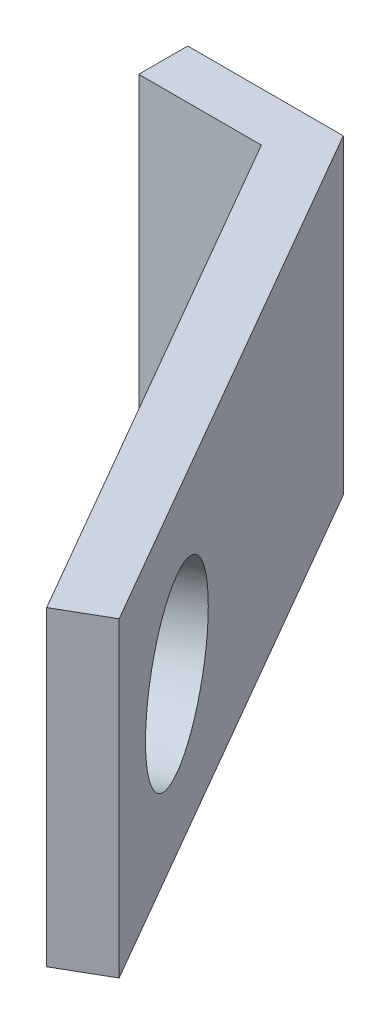
ISO-10303-21;
HEADER;
FILE_DESCRIPTION(('STEP AP214'),'2;1');
FILE_NAME('part.step','',(''),(''),'','','');
FILE_SCHEMA(('AUTOMOTIVE_DESIGN { 1 0 10303 214 1 1 1 1 }'));
ENDSEC;
DATA;
#1=APPLICATION_CONTEXT('core data for automotive mechanical design processes');
#2=APPLICATION_PROTOCOL_DEFINITION('international standard','automotive_design',2000,#1);
#3=PRODUCT_CONTEXT('',#1,'mechanical');
#4=PRODUCT('Part','Part','',(#3));
#5=PRODUCT_RELATED_PRODUCT_CATEGORY('part','',(#4));
#6=PRODUCT_DEFINITION_FORMATION('','',#4);
#7=PRODUCT_DEFINITION_CONTEXT('part definition',#1,'design');
#8=PRODUCT_DEFINITION('design','',#6,#7);
#9=PRODUCT_DEFINITION_SHAPE('','',#8);
#10=(LENGTH_UNIT() NAMED_UNIT(*) SI_UNIT(.MILLI.,.METRE.));
#11=(NAMED_UNIT(*) PLANE_ANGLE_UNIT() SI_UNIT($,.RADIAN.));
#12=(NAMED_UNIT(*) SI_UNIT($,.STERADIAN.) SOLID_ANGLE_UNIT());
#13=UNCERTAINTY_MEASURE_WITH_UNIT(LENGTH_MEASURE(1.E-05),#10,'distance_accuracy_value','');
#14=(GEOMETRIC_REPRESENTATION_CONTEXT(3) GLOBAL_UNCERTAINTY_ASSIGNED_CONTEXT((#13)) GLOBAL_UNIT_ASSIGNED_CONTEXT((#10,
#11,#12)) REPRESENTATION_CONTEXT('',''));
#15=CARTESIAN_POINT('',(0.,0.,0.));
#16=DIRECTION('',(0.,0.,1.));
#17=DIRECTION('',(1.,0.,0.));
#18=AXIS2_PLACEMENT_3D('',#15,#16,#17);
#19=CARTESIAN_POINT('',(0.,0.,2.));
#20=DIRECTION('',(1.,0.,0.));
#21=DIRECTION('',(0.,0.,-1.));
#22=AXIS2_PLACEMENT_3D('',#19,#20,#21);
#23=PLANE('',#22);
#24=DIRECTION('',(0.,-1.,0.));
#25=VECTOR('',#24,1.);
#26=CARTESIAN_POINT('',(0.,0.,0.));
#27=LINE('',#26,#25);
#28=CARTESIAN_POINT('',(0.,12.7,0.));
#29=VERTEX_POINT('',#28);
#30=CARTESIAN_POINT('',(0.,0.,0.));
#31=VERTEX_POINT('',#30);
#32=EDGE_CURVE('E136',#29,#31,#27,.T.);
#33=ORIENTED_EDGE('',*,*,#32,.T.);
#34=DIRECTION('',(0.,0.,-1.));
#35=VECTOR('',#34,1.);
#36=CARTESIAN_POINT('',(0.,0.,2.));
#37=LINE('',#36,#35);
#38=CARTESIAN_POINT('',(0.,0.,2.));
#39=VERTEX_POINT('',#38);
#40=EDGE_CURVE('E11',#39,#31,#37,.T.);
#41=ORIENTED_EDGE('',*,*,#40,.F.);
#42=DIRECTION('',(0.,-1.,0.));
#43=VECTOR('',#42,1.);
#44=CARTESIAN_POINT('',(0.,0.,2.));
#45=LINE('',#44,#43);
#46=CARTESIAN_POINT('',(0.,12.7,2.));
#47=VERTEX_POINT('',#46);
#48=EDGE_CURVE('E137',#47,#39,#45,.T.);
#49=ORIENTED_EDGE('',*,*,#48,.F.);
#50=DIRECTION('',(0.,0.,-1.));
#51=VECTOR('',#50,1.);
#52=CARTESIAN_POINT('',(0.,12.7,2.));
#53=LINE('',#52,#51);
#54=EDGE_CURVE('E48',#47,#29,#53,.T.);
#55=ORIENTED_EDGE('',*,*,#54,.T.);
#56=EDGE_LOOP('',(#33,#41,#49,#55));
#57=FACE_BOUND('',#56,.T.);
#58=ADVANCED_FACE('F39',(#57),#23,.F.);
#59=CARTESIAN_POINT('',(0.,0.,2.));
#60=DIRECTION('',(0.,1.,0.));
#61=DIRECTION('',(0.,0.,1.));
#62=AXIS2_PLACEMENT_3D('',#59,#60,#61);
#63=PLANE('',#62);
#64=DIRECTION('',(1.,0.,0.));
#65=VECTOR('',#64,1.);
#66=CARTESIAN_POINT('',(0.,0.,0.));
#67=LINE('',#66,#65);
#68=CARTESIAN_POINT('',(6.35,0.,0.));
#69=VERTEX_POINT('',#68);
#70=EDGE_CURVE('E116',#31,#69,#67,.T.);
#71=ORIENTED_EDGE('',*,*,#70,.T.);
#72=DIRECTION('',(0.500000000000004,0.,0.866025403784436));
#73=VECTOR('',#72,1.);
#74=CARTESIAN_POINT('',(6.35,0.,0.));
#75=LINE('',#74,#73);
#76=CARTESIAN_POINT('',(18.8500000000001,0.,21.6506350946109));
#77=VERTEX_POINT('',#76);
#78=EDGE_CURVE('E97',#69,#77,#75,.T.);
#79=ORIENTED_EDGE('',*,*,#78,.T.);
#80=DIRECTION('',(-0.866025403784435,0.,0.500000000000006));
#81=VECTOR('',#80,1.);
#82=CARTESIAN_POINT('',(18.8500000000001,0.,21.6506350946109));
#83=LINE('',#82,#81);
#84=CARTESIAN_POINT('',(16.9750000000001,0.,22.7331668493415));
#85=VERTEX_POINT('',#84);
#86=EDGE_CURVE('E107',#77,#85,#83,.T.);
#87=ORIENTED_EDGE('',*,*,#86,.T.);
#88=DIRECTION('',(-0.500000000000004,0.,-0.866025403784436));
#89=VECTOR('',#88,1.);
#90=CARTESIAN_POINT('',(16.9750000000001,0.,22.7331668493415));
#91=LINE('',#90,#89);
#92=CARTESIAN_POINT('',(5.00470053837927,0.,2.));
#93=VERTEX_POINT('',#92);
#94=EDGE_CURVE('E104',#85,#93,#91,.T.);
#95=ORIENTED_EDGE('',*,*,#94,.T.);
#96=DIRECTION('',(1.,0.,0.));
#97=VECTOR('',#96,1.);
#98=CARTESIAN_POINT('',(0.,0.,2.));
#99=LINE('',#98,#97);
#100=EDGE_CURVE('E60',#39,#93,#99,.T.);
#101=ORIENTED_EDGE('',*,*,#100,.F.);
#102=ORIENTED_EDGE('',*,*,#40,.T.);
#103=EDGE_LOOP('',(#71,#79,#87,#95,#101,#102));
#104=FACE_BOUND('',#103,.T.);
#105=ADVANCED_FACE('F115',(#104),#63,.F.);
#106=CARTESIAN_POINT('',(0.,12.7,2.));
#107=DIRECTION('',(0.,-1.,0.));
#108=DIRECTION('',(0.,0.,-1.));
#109=AXIS2_PLACEMENT_3D('',#106,#107,#108);
#110=PLANE('',#109);
#111=DIRECTION('',(-0.500000000000004,0.,-0.866025403784436));
#112=VECTOR('',#111,1.);
#113=CARTESIAN_POINT('',(6.35,12.7,0.));
#114=LINE('',#113,#112);
#115=CARTESIAN_POINT('',(18.8500000000001,12.7,21.6506350946109));
#116=VERTEX_POINT('',#115);
#117=CARTESIAN_POINT('',(6.35,12.7,0.));
#118=VERTEX_POINT('',#117);
#119=EDGE_CURVE('E99',#116,#118,#114,.T.);
#120=ORIENTED_EDGE('',*,*,#119,.T.);
#121=DIRECTION('',(-1.,0.,0.));
#122=VECTOR('',#121,1.);
#123=CARTESIAN_POINT('',(0.,12.7,0.));
#124=LINE('',#123,#122);
#125=EDGE_CURVE('E140',#118,#29,#124,.T.);
#126=ORIENTED_EDGE('',*,*,#125,.T.);
#127=ORIENTED_EDGE('',*,*,#54,.F.);
#128=DIRECTION('',(-1.,0.,0.));
#129=VECTOR('',#128,1.);
#130=CARTESIAN_POINT('',(0.,12.7,2.));
#131=LINE('',#130,#129);
#132=CARTESIAN_POINT('',(5.00470053837927,12.7,2.));
#133=VERTEX_POINT('',#132);
#134=EDGE_CURVE('E143',#133,#47,#131,.T.);
#135=ORIENTED_EDGE('',*,*,#134,.F.);
#136=DIRECTION('',(0.500000000000004,0.,0.866025403784436));
#137=VECTOR('',#136,1.);
#138=CARTESIAN_POINT('',(16.9750000000001,12.7,22.7331668493415));
#139=LINE('',#138,#137);
#140=CARTESIAN_POINT('',(16.9750000000001,12.7,22.7331668493415));
#141=VERTEX_POINT('',#140);
#142=EDGE_CURVE('E124',#133,#141,#139,.T.);
#143=ORIENTED_EDGE('',*,*,#142,.T.);
#144=DIRECTION('',(0.866025403784435,0.,-0.500000000000006));
#145=VECTOR('',#144,1.);
#146=CARTESIAN_POINT('',(18.8500000000001,12.7,21.6506350946109));
#147=LINE('',#146,#145);
#148=EDGE_CURVE('E130',#141,#116,#147,.T.);
#149=ORIENTED_EDGE('',*,*,#148,.T.);
#150=EDGE_LOOP('',(#120,#126,#127,#135,#143,#149));
#151=FACE_BOUND('',#150,.T.);
#152=ADVANCED_FACE('F168',(#151),#110,.F.);
#153=CARTESIAN_POINT('',(0.,0.,2.));
#154=DIRECTION('',(0.,0.,-1.));
#155=DIRECTION('',(-1.,0.,0.));
#156=AXIS2_PLACEMENT_3D('',#153,#154,#155);
#157=PLANE('',#156);
#158=ORIENTED_EDGE('',*,*,#100,.T.);
#159=DIRECTION('',(0.,1.,0.));
#160=VECTOR('',#159,1.);
#161=CARTESIAN_POINT('',(5.00470053837927,0.,2.));
#162=LINE('',#161,#160);
#163=EDGE_CURVE('E55',#93,#133,#162,.T.);
#164=ORIENTED_EDGE('',*,*,#163,.T.);
#165=ORIENTED_EDGE('',*,*,#134,.T.);
#166=ORIENTED_EDGE('',*,*,#48,.T.);
#167=EDGE_LOOP('',(#158,#164,#165,#166));
#168=FACE_BOUND('',#167,.T.);
#169=ADVANCED_FACE('F166',(#168),#157,.F.);
#170=CARTESIAN_POINT('',(0.,0.,0.));
#171=DIRECTION('',(0.,0.,-1.));
#172=DIRECTION('',(-1.,0.,0.));
#173=AXIS2_PLACEMENT_3D('',#170,#171,#172);
#174=PLANE('',#173);
#175=ORIENTED_EDGE('',*,*,#32,.F.);
#176=ORIENTED_EDGE('',*,*,#125,.F.);
#177=DIRECTION('',(0.,1.,0.));
#178=VECTOR('',#177,1.);
#179=CARTESIAN_POINT('',(6.35,0.,0.));
#180=LINE('',#179,#178);
#181=EDGE_CURVE('E151',#69,#118,#180,.T.);
#182=ORIENTED_EDGE('',*,*,#181,.F.);
#183=ORIENTED_EDGE('',*,*,#70,.F.);
#184=EDGE_LOOP('',(#175,#176,#182,#183));
#185=FACE_BOUND('',#184,.T.);
#186=ADVANCED_FACE('F165',(#185),#174,.T.);
#187=CARTESIAN_POINT('',(16.9750000000001,39.9359482118762,22.7331668493415));
#188=DIRECTION('',(-0.866025403784436,0.,0.500000000000004));
#189=DIRECTION('',(0.500000000000004,0.,0.866025403784436));
#190=AXIS2_PLACEMENT_3D('',#187,#188,#189);
#191=PLANE('',#190);
#192=CARTESIAN_POINT('',(13.7547005383793,6.35,17.1554445662276));
#193=DIRECTION('',(-0.866025403784436,0.,0.500000000000004));
#194=DIRECTION('',(0.500000000000004,0.,0.866025403784436));
#195=AXIS2_PLACEMENT_3D('',#192,#193,#194);
#196=CIRCLE('',#195,3.5);
#197=CARTESIAN_POINT('',(15.5047005383793,6.35,20.1865334794732));
#198=VERTEX_POINT('',#197);
#199=EDGE_CURVE('E122',#198,#198,#196,.T.);
#200=ORIENTED_EDGE('',*,*,#199,.F.);
#201=EDGE_LOOP('',(#200));
#202=FACE_BOUND('',#201,.T.);
#203=ORIENTED_EDGE('',*,*,#163,.F.);
#204=ORIENTED_EDGE('',*,*,#94,.F.);
#205=DIRECTION('',(0.,-1.,0.));
#206=VECTOR('',#205,1.);
#207=CARTESIAN_POINT('',(16.9750000000001,39.9359482118762,22.7331668493415));
#208=LINE('',#207,#206);
#209=EDGE_CURVE('E103',#141,#85,#208,.T.);
#210=ORIENTED_EDGE('',*,*,#209,.F.);
#211=ORIENTED_EDGE('',*,*,#142,.F.);
#212=EDGE_LOOP('',(#203,#204,#210,#211));
#213=FACE_BOUND('',#212,.T.);
#214=ADVANCED_FACE('F170',(#202,#213),#191,.T.);
#215=CARTESIAN_POINT('',(18.8500000000001,39.9359482118762,21.6506350946109));
#216=DIRECTION('',(0.500000000000006,0.,0.866025403784435));
#217=DIRECTION('',(0.866025403784435,0.,-0.500000000000006));
#218=AXIS2_PLACEMENT_3D('',#215,#216,#217);
#219=PLANE('',#218);
#220=ORIENTED_EDGE('',*,*,#148,.F.);
#221=ORIENTED_EDGE('',*,*,#209,.T.);
#222=ORIENTED_EDGE('',*,*,#86,.F.);
#223=DIRECTION('',(0.,-1.,0.));
#224=VECTOR('',#223,1.);
#225=CARTESIAN_POINT('',(18.8500000000001,39.9359482118762,21.6506350946109));
#226=LINE('',#225,#224);
#227=EDGE_CURVE('E92',#116,#77,#226,.T.);
#228=ORIENTED_EDGE('',*,*,#227,.F.);
#229=EDGE_LOOP('',(#220,#221,#222,#228));
#230=FACE_BOUND('',#229,.T.);
#231=ADVANCED_FACE('F108',(#230),#219,.T.);
#232=CARTESIAN_POINT('',(6.35,39.9359482118762,0.));
#233=DIRECTION('',(0.866025403784436,0.,-0.500000000000004));
#234=DIRECTION('',(-0.500000000000004,0.,-0.866025403784436));
#235=AXIS2_PLACEMENT_3D('',#232,#233,#234);
#236=PLANE('',#235);
#237=CARTESIAN_POINT('',(15.6297005383793,6.35,16.0729128114971));
#238=DIRECTION('',(0.866025403784436,0.,-0.500000000000004));
#239=DIRECTION('',(-0.500000000000004,0.,-0.866025403784436));
#240=AXIS2_PLACEMENT_3D('',#237,#238,#239);
#241=CIRCLE('',#240,3.5);
#242=CARTESIAN_POINT('',(13.8797005383793,6.35,13.0418238982516));
#243=VERTEX_POINT('',#242);
#244=EDGE_CURVE('E42',#243,#243,#241,.T.);
#245=ORIENTED_EDGE('',*,*,#244,.F.);
#246=EDGE_LOOP('',(#245));
#247=FACE_BOUND('',#246,.T.);
#248=ORIENTED_EDGE('',*,*,#119,.F.);
#249=ORIENTED_EDGE('',*,*,#227,.T.);
#250=ORIENTED_EDGE('',*,*,#78,.F.);
#251=ORIENTED_EDGE('',*,*,#181,.T.);
#252=EDGE_LOOP('',(#248,#249,#250,#251));
#253=FACE_BOUND('',#252,.T.);
#254=ADVANCED_FACE('F94',(#247,#253),#236,.T.);
#255=CARTESIAN_POINT('',(25.0047005383793,6.35,10.6602540378443));
#256=DIRECTION('',(-0.866025403784436,0.,0.500000000000004));
#257=DIRECTION('',(0.500000000000004,0.,0.866025403784436));
#258=AXIS2_PLACEMENT_3D('',#255,#256,#257);
#259=CYLINDRICAL_SURFACE('',#258,3.5);
#260=ORIENTED_EDGE('',*,*,#244,.T.);
#261=EDGE_LOOP('',(#260));
#262=FACE_BOUND('',#261,.T.);
#263=ORIENTED_EDGE('',*,*,#199,.T.);
#264=EDGE_LOOP('',(#263));
#265=FACE_BOUND('',#264,.T.);
#266=ADVANCED_FACE('F178',(#262,#265),#259,.F.);
#267=CLOSED_SHELL('',(#58,#105,#152,#169,#186,#214,#231,#254,#266));
#268=MANIFOLD_SOLID_BREP('B2',#267);
#269=ADVANCED_BREP_SHAPE_REPRESENTATION('',(#18,#268),#14);
#270=SHAPE_DEFINITION_REPRESENTATION(#9,#269);
ENDSEC;
END-ISO-10303-21;
